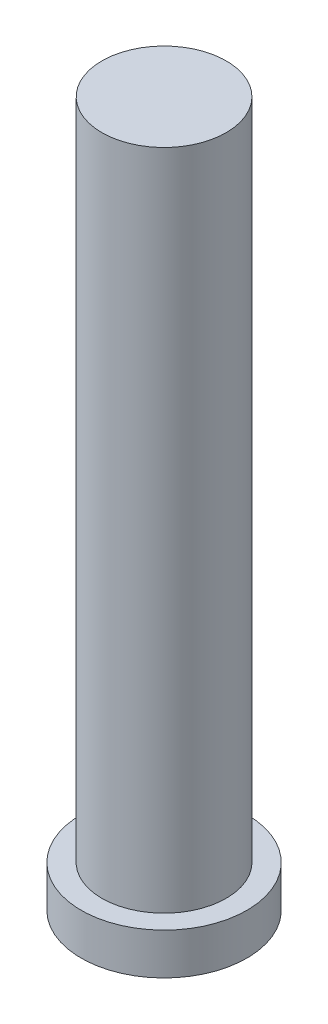
ISO-10303-21;
HEADER;
FILE_DESCRIPTION(('STEP AP214'),'2;1');
FILE_NAME('part.step','',(''),(''),'','','');
FILE_SCHEMA(('AUTOMOTIVE_DESIGN { 1 0 10303 214 1 1 1 1 }'));
ENDSEC;
DATA;
#1=APPLICATION_CONTEXT('core data for automotive mechanical design processes');
#2=APPLICATION_PROTOCOL_DEFINITION('international standard','automotive_design',2000,#1);
#3=PRODUCT_CONTEXT('',#1,'mechanical');
#4=PRODUCT('Part','Part','',(#3));
#5=PRODUCT_RELATED_PRODUCT_CATEGORY('part','',(#4));
#6=PRODUCT_DEFINITION_FORMATION('','',#4);
#7=PRODUCT_DEFINITION_CONTEXT('part definition',#1,'design');
#8=PRODUCT_DEFINITION('design','',#6,#7);
#9=PRODUCT_DEFINITION_SHAPE('','',#8);
#10=(LENGTH_UNIT() NAMED_UNIT(*) SI_UNIT(.MILLI.,.METRE.));
#11=(NAMED_UNIT(*) PLANE_ANGLE_UNIT() SI_UNIT($,.RADIAN.));
#12=(NAMED_UNIT(*) SI_UNIT($,.STERADIAN.) SOLID_ANGLE_UNIT());
#13=UNCERTAINTY_MEASURE_WITH_UNIT(LENGTH_MEASURE(1.E-05),#10,'distance_accuracy_value','');
#14=(GEOMETRIC_REPRESENTATION_CONTEXT(3) GLOBAL_UNCERTAINTY_ASSIGNED_CONTEXT((#13)) GLOBAL_UNIT_ASSIGNED_CONTEXT((#10,
#11,#12)) REPRESENTATION_CONTEXT('',''));
#15=CARTESIAN_POINT('',(0.,0.,0.));
#16=DIRECTION('',(0.,0.,1.));
#17=DIRECTION('',(1.,0.,0.));
#18=AXIS2_PLACEMENT_3D('',#15,#16,#17);
#19=CARTESIAN_POINT('',(0.,8.,0.));
#20=DIRECTION('',(0.,-1.,0.));
#21=DIRECTION('',(0.,0.,-1.));
#22=AXIS2_PLACEMENT_3D('',#19,#20,#21);
#23=CYLINDRICAL_SURFACE('',#22,0.75);
#24=CARTESIAN_POINT('',(0.,8.,0.));
#25=DIRECTION('',(0.,1.,0.));
#26=DIRECTION('',(0.,0.,1.));
#27=AXIS2_PLACEMENT_3D('',#24,#25,#26);
#28=CIRCLE('',#27,0.75);
#29=CARTESIAN_POINT('',(0.,8.,0.75));
#30=VERTEX_POINT('',#29);
#31=EDGE_CURVE('E10',#30,#30,#28,.T.);
#32=ORIENTED_EDGE('',*,*,#31,.F.);
#33=EDGE_LOOP('',(#32));
#34=FACE_BOUND('',#33,.T.);
#35=CARTESIAN_POINT('',(0.,0.,0.));
#36=DIRECTION('',(0.,1.,0.));
#37=DIRECTION('',(0.,0.,1.));
#38=AXIS2_PLACEMENT_3D('',#35,#36,#37);
#39=CIRCLE('',#38,0.75);
#40=CARTESIAN_POINT('',(0.,0.,0.75));
#41=VERTEX_POINT('',#40);
#42=EDGE_CURVE('E38',#41,#41,#39,.T.);
#43=ORIENTED_EDGE('',*,*,#42,.T.);
#44=EDGE_LOOP('',(#43));
#45=FACE_BOUND('',#44,.T.);
#46=ADVANCED_FACE('F35',(#34,#45),#23,.T.);
#47=CARTESIAN_POINT('',(0.,8.,0.));
#48=DIRECTION('',(0.,1.,0.));
#49=DIRECTION('',(0.,0.,1.));
#50=AXIS2_PLACEMENT_3D('',#47,#48,#49);
#51=PLANE('',#50);
#52=ORIENTED_EDGE('',*,*,#31,.T.);
#53=EDGE_LOOP('',(#52));
#54=FACE_BOUND('',#53,.T.);
#55=ADVANCED_FACE('F58',(#54),#51,.T.);
#56=CARTESIAN_POINT('',(0.,-0.5,0.));
#57=DIRECTION('',(0.,1.,0.));
#58=DIRECTION('',(0.,0.,1.));
#59=AXIS2_PLACEMENT_3D('',#56,#57,#58);
#60=CYLINDRICAL_SURFACE('',#59,1.);
#61=CARTESIAN_POINT('',(0.,-0.5,0.));
#62=DIRECTION('',(0.,-1.,0.));
#63=DIRECTION('',(0.,0.,-1.));
#64=AXIS2_PLACEMENT_3D('',#61,#62,#63);
#65=CIRCLE('',#64,1.);
#66=CARTESIAN_POINT('',(0.,-0.5,-1.));
#67=VERTEX_POINT('',#66);
#68=EDGE_CURVE('E45',#67,#67,#65,.T.);
#69=ORIENTED_EDGE('',*,*,#68,.F.);
#70=EDGE_LOOP('',(#69));
#71=FACE_BOUND('',#70,.T.);
#72=CARTESIAN_POINT('',(0.,0.,0.));
#73=DIRECTION('',(0.,-1.,0.));
#74=DIRECTION('',(0.,0.,-1.));
#75=AXIS2_PLACEMENT_3D('',#72,#73,#74);
#76=CIRCLE('',#75,1.);
#77=CARTESIAN_POINT('',(0.,0.,-1.));
#78=VERTEX_POINT('',#77);
#79=EDGE_CURVE('E47',#78,#78,#76,.T.);
#80=ORIENTED_EDGE('',*,*,#79,.T.);
#81=EDGE_LOOP('',(#80));
#82=FACE_BOUND('',#81,.T.);
#83=ADVANCED_FACE('F55',(#71,#82),#60,.T.);
#84=CARTESIAN_POINT('',(0.,-0.5,0.));
#85=DIRECTION('',(0.,-1.,0.));
#86=DIRECTION('',(0.,0.,-1.));
#87=AXIS2_PLACEMENT_3D('',#84,#85,#86);
#88=PLANE('',#87);
#89=ORIENTED_EDGE('',*,*,#68,.T.);
#90=EDGE_LOOP('',(#89));
#91=FACE_BOUND('',#90,.T.);
#92=ADVANCED_FACE('F53',(#91),#88,.T.);
#93=CARTESIAN_POINT('',(0.,0.,0.));
#94=DIRECTION('',(0.,-1.,0.));
#95=DIRECTION('',(0.,0.,-1.));
#96=AXIS2_PLACEMENT_3D('',#93,#94,#95);
#97=PLANE('',#96);
#98=ORIENTED_EDGE('',*,*,#42,.F.);
#99=EDGE_LOOP('',(#98));
#100=FACE_BOUND('',#99,.T.);
#101=ORIENTED_EDGE('',*,*,#79,.F.);
#102=EDGE_LOOP('',(#101));
#103=FACE_BOUND('',#102,.T.);
#104=ADVANCED_FACE('F62',(#100,#103),#97,.F.);
#105=CLOSED_SHELL('',(#46,#55,#83,#92,#104));
#106=MANIFOLD_SOLID_BREP('B2',#105);
#107=ADVANCED_BREP_SHAPE_REPRESENTATION('',(#18,#106),#14);
#108=SHAPE_DEFINITION_REPRESENTATION(#9,#107);
ENDSEC;
END-ISO-10303-21;
